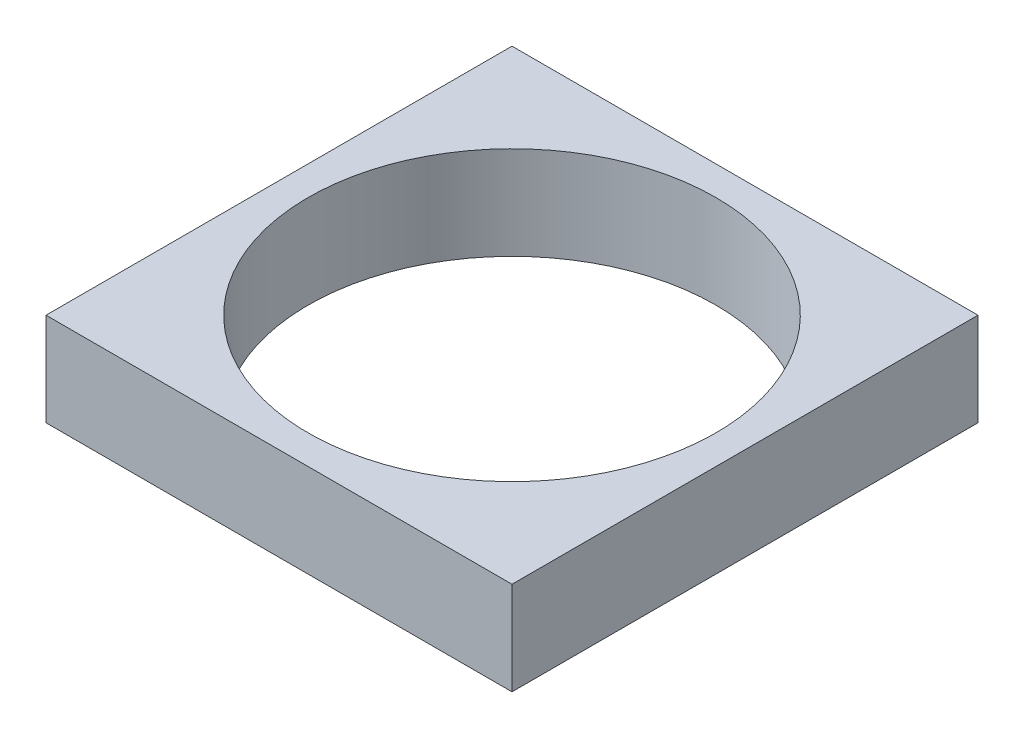
ISO-10303-21;
HEADER;
FILE_DESCRIPTION(('STEP AP214'),'2;1');
FILE_NAME('part.step','',(''),(''),'','','');
FILE_SCHEMA(('AUTOMOTIVE_DESIGN { 1 0 10303 214 1 1 1 1 }'));
ENDSEC;
DATA;
#1=APPLICATION_CONTEXT('core data for automotive mechanical design processes');
#2=APPLICATION_PROTOCOL_DEFINITION('international standard','automotive_design',2000,#1);
#3=PRODUCT_CONTEXT('',#1,'mechanical');
#4=PRODUCT('Part','Part','',(#3));
#5=PRODUCT_RELATED_PRODUCT_CATEGORY('part','',(#4));
#6=PRODUCT_DEFINITION_FORMATION('','',#4);
#7=PRODUCT_DEFINITION_CONTEXT('part definition',#1,'design');
#8=PRODUCT_DEFINITION('design','',#6,#7);
#9=PRODUCT_DEFINITION_SHAPE('','',#8);
#10=(LENGTH_UNIT() NAMED_UNIT(*) SI_UNIT(.MILLI.,.METRE.));
#11=(NAMED_UNIT(*) PLANE_ANGLE_UNIT() SI_UNIT($,.RADIAN.));
#12=(NAMED_UNIT(*) SI_UNIT($,.STERADIAN.) SOLID_ANGLE_UNIT());
#13=UNCERTAINTY_MEASURE_WITH_UNIT(LENGTH_MEASURE(1.E-05),#10,'distance_accuracy_value','');
#14=(GEOMETRIC_REPRESENTATION_CONTEXT(3) GLOBAL_UNCERTAINTY_ASSIGNED_CONTEXT((#13)) GLOBAL_UNIT_ASSIGNED_CONTEXT((#10,
#11,#12)) REPRESENTATION_CONTEXT('',''));
#15=CARTESIAN_POINT('',(0.,0.,0.));
#16=DIRECTION('',(0.,0.,1.));
#17=DIRECTION('',(1.,0.,0.));
#18=AXIS2_PLACEMENT_3D('',#15,#16,#17);
#19=CARTESIAN_POINT('',(40.,16.,-40.));
#20=DIRECTION('',(-1.,0.,0.));
#21=DIRECTION('',(0.,0.,1.));
#22=AXIS2_PLACEMENT_3D('',#19,#20,#21);
#23=PLANE('',#22);
#24=DIRECTION('',(0.,0.,-1.));
#25=VECTOR('',#24,1.);
#26=CARTESIAN_POINT('',(40.,0.,-40.));
#27=LINE('',#26,#25);
#28=CARTESIAN_POINT('',(40.,0.,40.));
#29=VERTEX_POINT('',#28);
#30=CARTESIAN_POINT('',(40.,0.,-40.));
#31=VERTEX_POINT('',#30);
#32=EDGE_CURVE('E96',#29,#31,#27,.T.);
#33=ORIENTED_EDGE('',*,*,#32,.T.);
#34=DIRECTION('',(0.,-1.,0.));
#35=VECTOR('',#34,1.);
#36=CARTESIAN_POINT('',(40.,16.,-40.));
#37=LINE('',#36,#35);
#38=CARTESIAN_POINT('',(40.,16.,-40.));
#39=VERTEX_POINT('',#38);
#40=EDGE_CURVE('E11',#39,#31,#37,.T.);
#41=ORIENTED_EDGE('',*,*,#40,.F.);
#42=DIRECTION('',(0.,0.,-1.));
#43=VECTOR('',#42,1.);
#44=CARTESIAN_POINT('',(40.,16.,-40.));
#45=LINE('',#44,#43);
#46=CARTESIAN_POINT('',(40.,16.,40.));
#47=VERTEX_POINT('',#46);
#48=EDGE_CURVE('E84',#47,#39,#45,.T.);
#49=ORIENTED_EDGE('',*,*,#48,.F.);
#50=DIRECTION('',(0.,-1.,0.));
#51=VECTOR('',#50,1.);
#52=CARTESIAN_POINT('',(40.,16.,40.));
#53=LINE('',#52,#51);
#54=EDGE_CURVE('E92',#47,#29,#53,.T.);
#55=ORIENTED_EDGE('',*,*,#54,.T.);
#56=EDGE_LOOP('',(#33,#41,#49,#55));
#57=FACE_BOUND('',#56,.T.);
#58=ADVANCED_FACE('F33',(#57),#23,.F.);
#59=CARTESIAN_POINT('',(-40.,16.,-40.));
#60=DIRECTION('',(0.,0.,1.));
#61=DIRECTION('',(1.,0.,0.));
#62=AXIS2_PLACEMENT_3D('',#59,#60,#61);
#63=PLANE('',#62);
#64=DIRECTION('',(-1.,0.,0.));
#65=VECTOR('',#64,1.);
#66=CARTESIAN_POINT('',(-40.,0.,-40.));
#67=LINE('',#66,#65);
#68=CARTESIAN_POINT('',(-40.,0.,-40.));
#69=VERTEX_POINT('',#68);
#70=EDGE_CURVE('E88',#31,#69,#67,.T.);
#71=ORIENTED_EDGE('',*,*,#70,.T.);
#72=DIRECTION('',(0.,-1.,0.));
#73=VECTOR('',#72,1.);
#74=CARTESIAN_POINT('',(-40.,16.,-40.));
#75=LINE('',#74,#73);
#76=CARTESIAN_POINT('',(-40.,16.,-40.));
#77=VERTEX_POINT('',#76);
#78=EDGE_CURVE('E41',#77,#69,#75,.T.);
#79=ORIENTED_EDGE('',*,*,#78,.F.);
#80=DIRECTION('',(-1.,0.,0.));
#81=VECTOR('',#80,1.);
#82=CARTESIAN_POINT('',(-40.,16.,-40.));
#83=LINE('',#82,#81);
#84=EDGE_CURVE('E79',#39,#77,#83,.T.);
#85=ORIENTED_EDGE('',*,*,#84,.F.);
#86=ORIENTED_EDGE('',*,*,#40,.T.);
#87=EDGE_LOOP('',(#71,#79,#85,#86));
#88=FACE_BOUND('',#87,.T.);
#89=ADVANCED_FACE('F87',(#88),#63,.F.);
#90=CARTESIAN_POINT('',(-40.,16.,-40.));
#91=DIRECTION('',(1.,0.,0.));
#92=DIRECTION('',(0.,0.,-1.));
#93=AXIS2_PLACEMENT_3D('',#90,#91,#92);
#94=PLANE('',#93);
#95=DIRECTION('',(0.,0.,1.));
#96=VECTOR('',#95,1.);
#97=CARTESIAN_POINT('',(-40.,0.,-40.));
#98=LINE('',#97,#96);
#99=CARTESIAN_POINT('',(-40.,0.,40.));
#100=VERTEX_POINT('',#99);
#101=EDGE_CURVE('E66',#69,#100,#98,.T.);
#102=ORIENTED_EDGE('',*,*,#101,.T.);
#103=DIRECTION('',(0.,-1.,0.));
#104=VECTOR('',#103,1.);
#105=CARTESIAN_POINT('',(-40.,16.,40.));
#106=LINE('',#105,#104);
#107=CARTESIAN_POINT('',(-40.,16.,40.));
#108=VERTEX_POINT('',#107);
#109=EDGE_CURVE('E89',#108,#100,#106,.T.);
#110=ORIENTED_EDGE('',*,*,#109,.F.);
#111=DIRECTION('',(0.,0.,1.));
#112=VECTOR('',#111,1.);
#113=CARTESIAN_POINT('',(-40.,16.,-40.));
#114=LINE('',#113,#112);
#115=EDGE_CURVE('E82',#77,#108,#114,.T.);
#116=ORIENTED_EDGE('',*,*,#115,.F.);
#117=ORIENTED_EDGE('',*,*,#78,.T.);
#118=EDGE_LOOP('',(#102,#110,#116,#117));
#119=FACE_BOUND('',#118,.T.);
#120=ADVANCED_FACE('F90',(#119),#94,.F.);
#121=CARTESIAN_POINT('',(-40.,16.,40.));
#122=DIRECTION('',(0.,0.,-1.));
#123=DIRECTION('',(-1.,0.,0.));
#124=AXIS2_PLACEMENT_3D('',#121,#122,#123);
#125=PLANE('',#124);
#126=DIRECTION('',(1.,0.,0.));
#127=VECTOR('',#126,1.);
#128=CARTESIAN_POINT('',(-40.,0.,40.));
#129=LINE('',#128,#127);
#130=EDGE_CURVE('E72',#100,#29,#129,.T.);
#131=ORIENTED_EDGE('',*,*,#130,.T.);
#132=ORIENTED_EDGE('',*,*,#54,.F.);
#133=DIRECTION('',(1.,0.,0.));
#134=VECTOR('',#133,1.);
#135=CARTESIAN_POINT('',(-40.,16.,40.));
#136=LINE('',#135,#134);
#137=EDGE_CURVE('E49',#108,#47,#136,.T.);
#138=ORIENTED_EDGE('',*,*,#137,.F.);
#139=ORIENTED_EDGE('',*,*,#109,.T.);
#140=EDGE_LOOP('',(#131,#132,#138,#139));
#141=FACE_BOUND('',#140,.T.);
#142=ADVANCED_FACE('F104',(#141),#125,.F.);
#143=CARTESIAN_POINT('',(0.,16.,0.));
#144=DIRECTION('',(0.,1.,0.));
#145=DIRECTION('',(0.,0.,1.));
#146=AXIS2_PLACEMENT_3D('',#143,#144,#145);
#147=PLANE('',#146);
#148=CARTESIAN_POINT('',(0.,16.,0.));
#149=DIRECTION('',(0.,-1.,0.));
#150=DIRECTION('',(0.,0.,-1.));
#151=AXIS2_PLACEMENT_3D('',#148,#149,#150);
#152=CIRCLE('',#151,35.);
#153=CARTESIAN_POINT('',(0.,16.,-35.));
#154=VERTEX_POINT('',#153);
#155=EDGE_CURVE('E99',#154,#154,#152,.T.);
#156=ORIENTED_EDGE('',*,*,#155,.T.);
#157=EDGE_LOOP('',(#156));
#158=FACE_BOUND('',#157,.T.);
#159=ORIENTED_EDGE('',*,*,#48,.T.);
#160=ORIENTED_EDGE('',*,*,#84,.T.);
#161=ORIENTED_EDGE('',*,*,#115,.T.);
#162=ORIENTED_EDGE('',*,*,#137,.T.);
#163=EDGE_LOOP('',(#159,#160,#161,#162));
#164=FACE_BOUND('',#163,.T.);
#165=ADVANCED_FACE('F80',(#158,#164),#147,.T.);
#166=CARTESIAN_POINT('',(0.,0.,0.));
#167=DIRECTION('',(0.,1.,0.));
#168=DIRECTION('',(0.,0.,1.));
#169=AXIS2_PLACEMENT_3D('',#166,#167,#168);
#170=PLANE('',#169);
#171=CARTESIAN_POINT('',(0.,0.,0.));
#172=DIRECTION('',(0.,-1.,0.));
#173=DIRECTION('',(0.,0.,-1.));
#174=AXIS2_PLACEMENT_3D('',#171,#172,#173);
#175=CIRCLE('',#174,35.);
#176=CARTESIAN_POINT('',(0.,0.,-35.));
#177=VERTEX_POINT('',#176);
#178=EDGE_CURVE('E110',#177,#177,#175,.T.);
#179=ORIENTED_EDGE('',*,*,#178,.F.);
#180=EDGE_LOOP('',(#179));
#181=FACE_BOUND('',#180,.T.);
#182=ORIENTED_EDGE('',*,*,#32,.F.);
#183=ORIENTED_EDGE('',*,*,#130,.F.);
#184=ORIENTED_EDGE('',*,*,#101,.F.);
#185=ORIENTED_EDGE('',*,*,#70,.F.);
#186=EDGE_LOOP('',(#182,#183,#184,#185));
#187=FACE_BOUND('',#186,.T.);
#188=ADVANCED_FACE('F107',(#181,#187),#170,.F.);
#189=CARTESIAN_POINT('',(0.,16.,0.));
#190=DIRECTION('',(0.,-1.,0.));
#191=DIRECTION('',(0.,0.,-1.));
#192=AXIS2_PLACEMENT_3D('',#189,#190,#191);
#193=CYLINDRICAL_SURFACE('',#192,35.);
#194=ORIENTED_EDGE('',*,*,#155,.F.);
#195=EDGE_LOOP('',(#194));
#196=FACE_BOUND('',#195,.T.);
#197=ORIENTED_EDGE('',*,*,#178,.T.);
#198=EDGE_LOOP('',(#197));
#199=FACE_BOUND('',#198,.T.);
#200=ADVANCED_FACE('F117',(#196,#199),#193,.F.);
#201=CLOSED_SHELL('',(#58,#89,#120,#142,#165,#188,#200));
#202=MANIFOLD_SOLID_BREP('B2',#201);
#203=ADVANCED_BREP_SHAPE_REPRESENTATION('',(#18,#202),#14);
#204=SHAPE_DEFINITION_REPRESENTATION(#9,#203);
ENDSEC;
END-ISO-10303-21;
